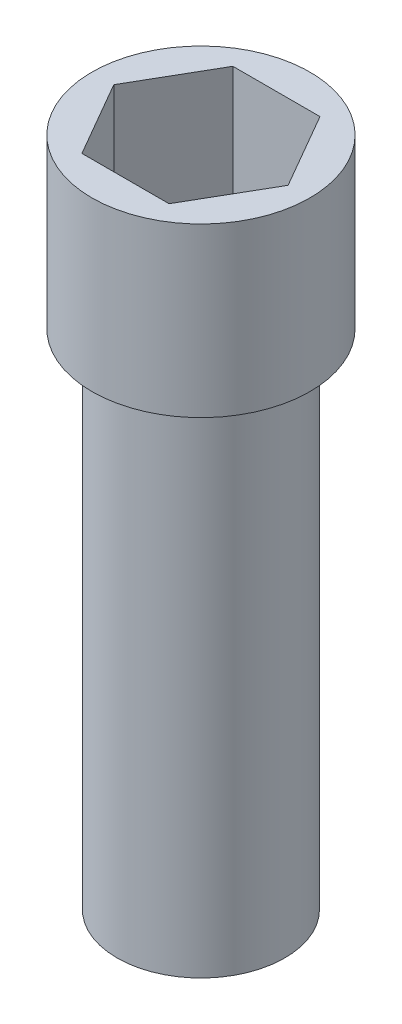
ISO-10303-21;
HEADER;
FILE_DESCRIPTION(('STEP AP214'),'2;1');
FILE_NAME('part.step','',(''),(''),'','','');
FILE_SCHEMA(('AUTOMOTIVE_DESIGN { 1 0 10303 214 1 1 1 1 }'));
ENDSEC;
DATA;
#1=APPLICATION_CONTEXT('core data for automotive mechanical design processes');
#2=APPLICATION_PROTOCOL_DEFINITION('international standard','automotive_design',2000,#1);
#3=PRODUCT_CONTEXT('',#1,'mechanical');
#4=PRODUCT('Part','Part','',(#3));
#5=PRODUCT_RELATED_PRODUCT_CATEGORY('part','',(#4));
#6=PRODUCT_DEFINITION_FORMATION('','',#4);
#7=PRODUCT_DEFINITION_CONTEXT('part definition',#1,'design');
#8=PRODUCT_DEFINITION('design','',#6,#7);
#9=PRODUCT_DEFINITION_SHAPE('','',#8);
#10=(LENGTH_UNIT() NAMED_UNIT(*) SI_UNIT(.MILLI.,.METRE.));
#11=(NAMED_UNIT(*) PLANE_ANGLE_UNIT() SI_UNIT($,.RADIAN.));
#12=(NAMED_UNIT(*) SI_UNIT($,.STERADIAN.) SOLID_ANGLE_UNIT());
#13=UNCERTAINTY_MEASURE_WITH_UNIT(LENGTH_MEASURE(1.E-05),#10,'distance_accuracy_value','');
#14=(GEOMETRIC_REPRESENTATION_CONTEXT(3) GLOBAL_UNCERTAINTY_ASSIGNED_CONTEXT((#13)) GLOBAL_UNIT_ASSIGNED_CONTEXT((#10,
#11,#12)) REPRESENTATION_CONTEXT('',''));
#15=CARTESIAN_POINT('',(0.,0.,0.));
#16=DIRECTION('',(0.,0.,1.));
#17=DIRECTION('',(1.,0.,0.));
#18=AXIS2_PLACEMENT_3D('',#15,#16,#17);
#19=CARTESIAN_POINT('',(0.,30.,0.));
#20=DIRECTION('',(0.,-1.,0.));
#21=DIRECTION('',(0.,0.,-1.));
#22=AXIS2_PLACEMENT_3D('',#19,#20,#21);
#23=CYLINDRICAL_SURFACE('',#22,5.);
#24=CARTESIAN_POINT('',(0.,30.,0.));
#25=DIRECTION('',(0.,1.,0.));
#26=DIRECTION('',(0.,0.,1.));
#27=AXIS2_PLACEMENT_3D('',#24,#25,#26);
#28=CIRCLE('',#27,5.);
#29=CARTESIAN_POINT('',(0.,30.,5.));
#30=VERTEX_POINT('',#29);
#31=EDGE_CURVE('E11',#30,#30,#28,.T.);
#32=ORIENTED_EDGE('',*,*,#31,.F.);
#33=EDGE_LOOP('',(#32));
#34=FACE_BOUND('',#33,.T.);
#35=CARTESIAN_POINT('',(0.,0.,0.));
#36=DIRECTION('',(0.,1.,0.));
#37=DIRECTION('',(0.,0.,1.));
#38=AXIS2_PLACEMENT_3D('',#35,#36,#37);
#39=CIRCLE('',#38,5.);
#40=CARTESIAN_POINT('',(0.,0.,5.));
#41=VERTEX_POINT('',#40);
#42=EDGE_CURVE('E46',#41,#41,#39,.T.);
#43=ORIENTED_EDGE('',*,*,#42,.T.);
#44=EDGE_LOOP('',(#43));
#45=FACE_BOUND('',#44,.T.);
#46=ADVANCED_FACE('F43',(#34,#45),#23,.T.);
#47=CARTESIAN_POINT('',(0.,0.,0.));
#48=DIRECTION('',(0.,1.,0.));
#49=DIRECTION('',(0.,0.,1.));
#50=AXIS2_PLACEMENT_3D('',#47,#48,#49);
#51=PLANE('',#50);
#52=ORIENTED_EDGE('',*,*,#42,.F.);
#53=EDGE_LOOP('',(#52));
#54=FACE_BOUND('',#53,.T.);
#55=ADVANCED_FACE('F178',(#54),#51,.F.);
#56=CARTESIAN_POINT('',(0.,32.,0.));
#57=DIRECTION('',(0.,-1.,0.));
#58=DIRECTION('',(0.,0.,-1.));
#59=AXIS2_PLACEMENT_3D('',#56,#57,#58);
#60=CYLINDRICAL_SURFACE('',#59,6.5);
#61=CARTESIAN_POINT('',(0.,30.,0.));
#62=DIRECTION('',(0.,1.,0.));
#63=DIRECTION('',(0.,0.,1.));
#64=AXIS2_PLACEMENT_3D('',#61,#62,#63);
#65=CIRCLE('',#64,6.5);
#66=CARTESIAN_POINT('',(0.,30.,6.5));
#67=VERTEX_POINT('',#66);
#68=EDGE_CURVE('E168',#67,#67,#65,.T.);
#69=ORIENTED_EDGE('',*,*,#68,.T.);
#70=EDGE_LOOP('',(#69));
#71=FACE_BOUND('',#70,.T.);
#72=CARTESIAN_POINT('',(0.,40.,0.));
#73=DIRECTION('',(0.,1.,0.));
#74=DIRECTION('',(0.,0.,1.));
#75=AXIS2_PLACEMENT_3D('',#72,#73,#74);
#76=CIRCLE('',#75,6.5);
#77=CARTESIAN_POINT('',(0.,40.,6.5));
#78=VERTEX_POINT('',#77);
#79=EDGE_CURVE('E112',#78,#78,#76,.T.);
#80=ORIENTED_EDGE('',*,*,#79,.F.);
#81=EDGE_LOOP('',(#80));
#82=FACE_BOUND('',#81,.T.);
#83=ADVANCED_FACE('F180',(#71,#82),#60,.T.);
#84=CARTESIAN_POINT('',(0.,30.,0.));
#85=DIRECTION('',(0.,1.,0.));
#86=DIRECTION('',(0.,0.,1.));
#87=AXIS2_PLACEMENT_3D('',#84,#85,#86);
#88=PLANE('',#87);
#89=ORIENTED_EDGE('',*,*,#31,.T.);
#90=EDGE_LOOP('',(#89));
#91=FACE_BOUND('',#90,.T.);
#92=ORIENTED_EDGE('',*,*,#68,.F.);
#93=EDGE_LOOP('',(#92));
#94=FACE_BOUND('',#93,.T.);
#95=ADVANCED_FACE('F185',(#91,#94),#88,.F.);
#96=CARTESIAN_POINT('',(0.,40.,0.));
#97=DIRECTION('',(0.,1.,0.));
#98=DIRECTION('',(0.,0.,1.));
#99=AXIS2_PLACEMENT_3D('',#96,#97,#98);
#100=PLANE('',#99);
#101=ORIENTED_EDGE('',*,*,#79,.T.);
#102=EDGE_LOOP('',(#101));
#103=FACE_BOUND('',#102,.T.);
#104=DIRECTION('',(-0.5,0.,-0.866025403784439));
#105=VECTOR('',#104,1.);
#106=CARTESIAN_POINT('',(5.19615242270663,40.,0.));
#107=LINE('',#106,#105);
#108=CARTESIAN_POINT('',(5.19615242270663,40.,0.));
#109=VERTEX_POINT('',#108);
#110=CARTESIAN_POINT('',(2.59807621135331,40.,-4.5));
#111=VERTEX_POINT('',#110);
#112=EDGE_CURVE('E105',#109,#111,#107,.T.);
#113=ORIENTED_EDGE('',*,*,#112,.F.);
#114=DIRECTION('',(0.5,0.,-0.866025403784439));
#115=VECTOR('',#114,1.);
#116=CARTESIAN_POINT('',(2.59807621135332,40.,4.5));
#117=LINE('',#116,#115);
#118=CARTESIAN_POINT('',(2.59807621135332,40.,4.5));
#119=VERTEX_POINT('',#118);
#120=EDGE_CURVE('E95',#119,#109,#117,.T.);
#121=ORIENTED_EDGE('',*,*,#120,.F.);
#122=DIRECTION('',(1.,0.,0.));
#123=VECTOR('',#122,1.);
#124=CARTESIAN_POINT('',(-2.59807621135332,40.,4.5));
#125=LINE('',#124,#123);
#126=CARTESIAN_POINT('',(-2.59807621135332,40.,4.5));
#127=VERTEX_POINT('',#126);
#128=EDGE_CURVE('E131',#127,#119,#125,.T.);
#129=ORIENTED_EDGE('',*,*,#128,.F.);
#130=DIRECTION('',(0.5,0.,0.866025403784438));
#131=VECTOR('',#130,1.);
#132=CARTESIAN_POINT('',(-5.19615242270663,40.,0.));
#133=LINE('',#132,#131);
#134=CARTESIAN_POINT('',(-5.19615242270663,40.,0.));
#135=VERTEX_POINT('',#134);
#136=EDGE_CURVE('E127',#135,#127,#133,.T.);
#137=ORIENTED_EDGE('',*,*,#136,.F.);
#138=DIRECTION('',(-0.5,0.,0.866025403784439));
#139=VECTOR('',#138,1.);
#140=CARTESIAN_POINT('',(-2.59807621135332,40.,-4.5));
#141=LINE('',#140,#139);
#142=CARTESIAN_POINT('',(-2.59807621135332,40.,-4.5));
#143=VERTEX_POINT('',#142);
#144=EDGE_CURVE('E122',#143,#135,#141,.T.);
#145=ORIENTED_EDGE('',*,*,#144,.F.);
#146=DIRECTION('',(-1.,0.,0.));
#147=VECTOR('',#146,1.);
#148=CARTESIAN_POINT('',(2.59807621135331,40.,-4.5));
#149=LINE('',#148,#147);
#150=EDGE_CURVE('E118',#111,#143,#149,.T.);
#151=ORIENTED_EDGE('',*,*,#150,.F.);
#152=EDGE_LOOP('',(#113,#121,#129,#137,#145,#151));
#153=FACE_BOUND('',#152,.T.);
#154=ADVANCED_FACE('F116',(#103,#153),#100,.T.);
#155=CARTESIAN_POINT('',(2.59807621135332,40.,4.5));
#156=DIRECTION('',(-0.866025403784439,0.,-0.5));
#157=DIRECTION('',(-0.5,0.,0.866025403784439));
#158=AXIS2_PLACEMENT_3D('',#155,#156,#157);
#159=PLANE('',#158);
#160=DIRECTION('',(0.5,0.,-0.866025403784439));
#161=VECTOR('',#160,1.);
#162=CARTESIAN_POINT('',(2.59807621135332,32.,4.5));
#163=LINE('',#162,#161);
#164=CARTESIAN_POINT('',(2.59807621135332,32.,4.5));
#165=VERTEX_POINT('',#164);
#166=CARTESIAN_POINT('',(5.19615242270663,32.,0.));
#167=VERTEX_POINT('',#166);
#168=EDGE_CURVE('E58',#165,#167,#163,.T.);
#169=ORIENTED_EDGE('',*,*,#168,.F.);
#170=DIRECTION('',(0.,-1.,0.));
#171=VECTOR('',#170,1.);
#172=CARTESIAN_POINT('',(2.59807621135332,40.,4.5));
#173=LINE('',#172,#171);
#174=EDGE_CURVE('E100',#119,#165,#173,.T.);
#175=ORIENTED_EDGE('',*,*,#174,.F.);
#176=ORIENTED_EDGE('',*,*,#120,.T.);
#177=DIRECTION('',(0.,-1.,0.));
#178=VECTOR('',#177,1.);
#179=CARTESIAN_POINT('',(5.19615242270663,40.,0.));
#180=LINE('',#179,#178);
#181=EDGE_CURVE('E98',#109,#167,#180,.T.);
#182=ORIENTED_EDGE('',*,*,#181,.T.);
#183=EDGE_LOOP('',(#169,#175,#176,#182));
#184=FACE_BOUND('',#183,.T.);
#185=ADVANCED_FACE('F97',(#184),#159,.T.);
#186=CARTESIAN_POINT('',(5.19615242270663,40.,0.));
#187=DIRECTION('',(-0.866025403784439,0.,0.5));
#188=DIRECTION('',(0.5,0.,0.866025403784439));
#189=AXIS2_PLACEMENT_3D('',#186,#187,#188);
#190=PLANE('',#189);
#191=DIRECTION('',(-0.5,0.,-0.866025403784439));
#192=VECTOR('',#191,1.);
#193=CARTESIAN_POINT('',(5.19615242270663,32.,0.));
#194=LINE('',#193,#192);
#195=CARTESIAN_POINT('',(2.59807621135331,32.,-4.5));
#196=VERTEX_POINT('',#195);
#197=EDGE_CURVE('E62',#167,#196,#194,.T.);
#198=ORIENTED_EDGE('',*,*,#197,.F.);
#199=ORIENTED_EDGE('',*,*,#181,.F.);
#200=ORIENTED_EDGE('',*,*,#112,.T.);
#201=DIRECTION('',(0.,-1.,0.));
#202=VECTOR('',#201,1.);
#203=CARTESIAN_POINT('',(2.59807621135331,40.,-4.5));
#204=LINE('',#203,#202);
#205=EDGE_CURVE('E113',#111,#196,#204,.T.);
#206=ORIENTED_EDGE('',*,*,#205,.T.);
#207=EDGE_LOOP('',(#198,#199,#200,#206));
#208=FACE_BOUND('',#207,.T.);
#209=ADVANCED_FACE('F109',(#208),#190,.T.);
#210=CARTESIAN_POINT('',(2.59807621135331,40.,-4.5));
#211=DIRECTION('',(0.,0.,1.));
#212=DIRECTION('',(1.,0.,0.));
#213=AXIS2_PLACEMENT_3D('',#210,#211,#212);
#214=PLANE('',#213);
#215=DIRECTION('',(-1.,0.,0.));
#216=VECTOR('',#215,1.);
#217=CARTESIAN_POINT('',(2.59807621135331,32.,-4.5));
#218=LINE('',#217,#216);
#219=CARTESIAN_POINT('',(-2.59807621135332,32.,-4.5));
#220=VERTEX_POINT('',#219);
#221=EDGE_CURVE('E138',#196,#220,#218,.T.);
#222=ORIENTED_EDGE('',*,*,#221,.F.);
#223=ORIENTED_EDGE('',*,*,#205,.F.);
#224=ORIENTED_EDGE('',*,*,#150,.T.);
#225=DIRECTION('',(0.,-1.,0.));
#226=VECTOR('',#225,1.);
#227=CARTESIAN_POINT('',(-2.59807621135332,40.,-4.5));
#228=LINE('',#227,#226);
#229=EDGE_CURVE('E159',#143,#220,#228,.T.);
#230=ORIENTED_EDGE('',*,*,#229,.T.);
#231=EDGE_LOOP('',(#222,#223,#224,#230));
#232=FACE_BOUND('',#231,.T.);
#233=ADVANCED_FACE('F203',(#232),#214,.T.);
#234=CARTESIAN_POINT('',(-2.59807621135332,40.,-4.5));
#235=DIRECTION('',(0.866025403784439,0.,0.5));
#236=DIRECTION('',(0.5,0.,-0.866025403784439));
#237=AXIS2_PLACEMENT_3D('',#234,#235,#236);
#238=PLANE('',#237);
#239=DIRECTION('',(-0.5,0.,0.866025403784439));
#240=VECTOR('',#239,1.);
#241=CARTESIAN_POINT('',(-2.59807621135332,32.,-4.5));
#242=LINE('',#241,#240);
#243=CARTESIAN_POINT('',(-5.19615242270663,32.,0.));
#244=VERTEX_POINT('',#243);
#245=EDGE_CURVE('E141',#220,#244,#242,.T.);
#246=ORIENTED_EDGE('',*,*,#245,.F.);
#247=ORIENTED_EDGE('',*,*,#229,.F.);
#248=ORIENTED_EDGE('',*,*,#144,.T.);
#249=DIRECTION('',(0.,-1.,0.));
#250=VECTOR('',#249,1.);
#251=CARTESIAN_POINT('',(-5.19615242270663,40.,0.));
#252=LINE('',#251,#250);
#253=EDGE_CURVE('E155',#135,#244,#252,.T.);
#254=ORIENTED_EDGE('',*,*,#253,.T.);
#255=EDGE_LOOP('',(#246,#247,#248,#254));
#256=FACE_BOUND('',#255,.T.);
#257=ADVANCED_FACE('F206',(#256),#238,.T.);
#258=CARTESIAN_POINT('',(-5.19615242270663,40.,0.));
#259=DIRECTION('',(0.866025403784438,0.,-0.5));
#260=DIRECTION('',(-0.5,0.,-0.866025403784439));
#261=AXIS2_PLACEMENT_3D('',#258,#259,#260);
#262=PLANE('',#261);
#263=DIRECTION('',(0.5,0.,0.866025403784438));
#264=VECTOR('',#263,1.);
#265=CARTESIAN_POINT('',(-5.19615242270663,32.,0.));
#266=LINE('',#265,#264);
#267=CARTESIAN_POINT('',(-2.59807621135332,32.,4.5));
#268=VERTEX_POINT('',#267);
#269=EDGE_CURVE('E144',#244,#268,#266,.T.);
#270=ORIENTED_EDGE('',*,*,#269,.F.);
#271=ORIENTED_EDGE('',*,*,#253,.F.);
#272=ORIENTED_EDGE('',*,*,#136,.T.);
#273=DIRECTION('',(0.,-1.,0.));
#274=VECTOR('',#273,1.);
#275=CARTESIAN_POINT('',(-2.59807621135332,40.,4.5));
#276=LINE('',#275,#274);
#277=EDGE_CURVE('E151',#127,#268,#276,.T.);
#278=ORIENTED_EDGE('',*,*,#277,.T.);
#279=EDGE_LOOP('',(#270,#271,#272,#278));
#280=FACE_BOUND('',#279,.T.);
#281=ADVANCED_FACE('F210',(#280),#262,.T.);
#282=CARTESIAN_POINT('',(-2.59807621135332,40.,4.5));
#283=DIRECTION('',(0.,0.,-1.));
#284=DIRECTION('',(-1.,0.,0.));
#285=AXIS2_PLACEMENT_3D('',#282,#283,#284);
#286=PLANE('',#285);
#287=DIRECTION('',(1.,0.,0.));
#288=VECTOR('',#287,1.);
#289=CARTESIAN_POINT('',(-2.59807621135332,32.,4.5));
#290=LINE('',#289,#288);
#291=EDGE_CURVE('E106',#268,#165,#290,.T.);
#292=ORIENTED_EDGE('',*,*,#291,.F.);
#293=ORIENTED_EDGE('',*,*,#277,.F.);
#294=ORIENTED_EDGE('',*,*,#128,.T.);
#295=ORIENTED_EDGE('',*,*,#174,.T.);
#296=EDGE_LOOP('',(#292,#293,#294,#295));
#297=FACE_BOUND('',#296,.T.);
#298=ADVANCED_FACE('F195',(#297),#286,.T.);
#299=CARTESIAN_POINT('',(0.,32.,0.));
#300=DIRECTION('',(0.,1.,0.));
#301=DIRECTION('',(0.,0.,1.));
#302=AXIS2_PLACEMENT_3D('',#299,#300,#301);
#303=PLANE('',#302);
#304=ORIENTED_EDGE('',*,*,#168,.T.);
#305=ORIENTED_EDGE('',*,*,#197,.T.);
#306=ORIENTED_EDGE('',*,*,#221,.T.);
#307=ORIENTED_EDGE('',*,*,#245,.T.);
#308=ORIENTED_EDGE('',*,*,#269,.T.);
#309=ORIENTED_EDGE('',*,*,#291,.T.);
#310=EDGE_LOOP('',(#304,#305,#306,#307,#308,#309));
#311=FACE_BOUND('',#310,.T.);
#312=ADVANCED_FACE('F192',(#311),#303,.T.);
#313=CLOSED_SHELL('',(#46,#55,#83,#95,#154,#185,#209,#233,#257,#281,#298,#312));
#314=MANIFOLD_SOLID_BREP('B2',#313);
#315=ADVANCED_BREP_SHAPE_REPRESENTATION('',(#18,#314),#14);
#316=SHAPE_DEFINITION_REPRESENTATION(#9,#315);
ENDSEC;
END-ISO-10303-21;
